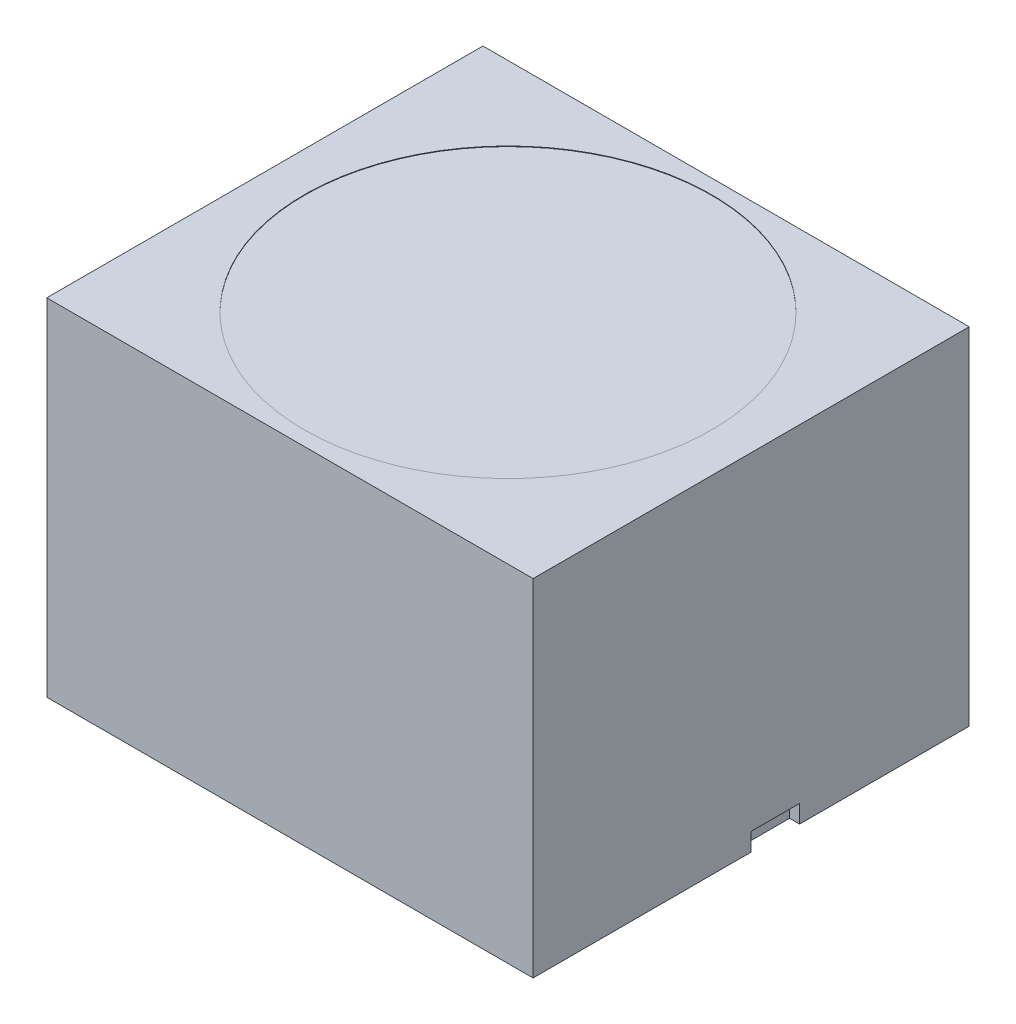
ISO-10303-21;
HEADER;
FILE_DESCRIPTION(('STEP AP214'),'2;1');
FILE_NAME('part.step','',(''),(''),'','','');
FILE_SCHEMA(('AUTOMOTIVE_DESIGN { 1 0 10303 214 1 1 1 1 }'));
ENDSEC;
DATA;
#1=APPLICATION_CONTEXT('core data for automotive mechanical design processes');
#2=APPLICATION_PROTOCOL_DEFINITION('international standard','automotive_design',2000,#1);
#3=PRODUCT_CONTEXT('',#1,'mechanical');
#4=PRODUCT('Part','Part','',(#3));
#5=PRODUCT_RELATED_PRODUCT_CATEGORY('part','',(#4));
#6=PRODUCT_DEFINITION_FORMATION('','',#4);
#7=PRODUCT_DEFINITION_CONTEXT('part definition',#1,'design');
#8=PRODUCT_DEFINITION('design','',#6,#7);
#9=PRODUCT_DEFINITION_SHAPE('','',#8);
#10=(LENGTH_UNIT() NAMED_UNIT(*) SI_UNIT(.MILLI.,.METRE.));
#11=(NAMED_UNIT(*) PLANE_ANGLE_UNIT() SI_UNIT($,.RADIAN.));
#12=(NAMED_UNIT(*) SI_UNIT($,.STERADIAN.) SOLID_ANGLE_UNIT());
#13=UNCERTAINTY_MEASURE_WITH_UNIT(LENGTH_MEASURE(1.E-05),#10,'distance_accuracy_value','');
#14=(GEOMETRIC_REPRESENTATION_CONTEXT(3) GLOBAL_UNCERTAINTY_ASSIGNED_CONTEXT((#13)) GLOBAL_UNIT_ASSIGNED_CONTEXT((#10,
#11,#12)) REPRESENTATION_CONTEXT('',''));
#15=CARTESIAN_POINT('',(0.,0.,0.));
#16=DIRECTION('',(0.,0.,1.));
#17=DIRECTION('',(1.,0.,0.));
#18=AXIS2_PLACEMENT_3D('',#15,#16,#17);
#19=CARTESIAN_POINT('',(48.5,69.,43.5));
#20=DIRECTION('',(-1.,0.,0.));
#21=DIRECTION('',(0.,0.,1.));
#22=AXIS2_PLACEMENT_3D('',#19,#20,#21);
#23=PLANE('',#22);
#24=DIRECTION('',(0.,0.,-1.));
#25=VECTOR('',#24,1.);
#26=CARTESIAN_POINT('',(48.5,0.,43.5));
#27=LINE('',#26,#25);
#28=CARTESIAN_POINT('',(48.5,0.,43.5));
#29=VERTEX_POINT('',#28);
#30=CARTESIAN_POINT('',(48.5,0.,0.));
#31=VERTEX_POINT('',#30);
#32=EDGE_CURVE('E148',#29,#31,#27,.T.);
#33=ORIENTED_EDGE('',*,*,#32,.T.);
#34=DIRECTION('',(0.,-1.,0.));
#35=VECTOR('',#34,1.);
#36=CARTESIAN_POINT('',(48.5,0.,0.));
#37=LINE('',#36,#35);
#38=CARTESIAN_POINT('',(48.5,3.57835867469044,0.));
#39=VERTEX_POINT('',#38);
#40=EDGE_CURVE('E168',#39,#31,#37,.T.);
#41=ORIENTED_EDGE('',*,*,#40,.F.);
#42=DIRECTION('',(0.,0.,1.));
#43=VECTOR('',#42,1.);
#44=CARTESIAN_POINT('',(48.5,3.57835867469044,0.));
#45=LINE('',#44,#43);
#46=CARTESIAN_POINT('',(48.5,3.57835867469044,-9.67173142205183));
#47=VERTEX_POINT('',#46);
#48=EDGE_CURVE('E192',#47,#39,#45,.T.);
#49=ORIENTED_EDGE('',*,*,#48,.F.);
#50=DIRECTION('',(0.,1.,0.));
#51=VECTOR('',#50,1.);
#52=CARTESIAN_POINT('',(48.5,0.,-9.67173142205183));
#53=LINE('',#52,#51);
#54=CARTESIAN_POINT('',(48.5,0.,-9.67173142205183));
#55=VERTEX_POINT('',#54);
#56=EDGE_CURVE('E190',#55,#47,#53,.T.);
#57=ORIENTED_EDGE('',*,*,#56,.F.);
#58=CARTESIAN_POINT('',(48.5,0.,-43.5));
#59=VERTEX_POINT('',#58);
#60=EDGE_CURVE('E127',#55,#59,#27,.T.);
#61=ORIENTED_EDGE('',*,*,#60,.T.);
#62=DIRECTION('',(0.,-1.,0.));
#63=VECTOR('',#62,1.);
#64=CARTESIAN_POINT('',(48.5,69.,-43.5));
#65=LINE('',#64,#63);
#66=CARTESIAN_POINT('',(48.5,69.,-43.5));
#67=VERTEX_POINT('',#66);
#68=EDGE_CURVE('E11',#67,#59,#65,.T.);
#69=ORIENTED_EDGE('',*,*,#68,.F.);
#70=DIRECTION('',(0.,0.,-1.));
#71=VECTOR('',#70,1.);
#72=CARTESIAN_POINT('',(48.5,69.,43.5));
#73=LINE('',#72,#71);
#74=CARTESIAN_POINT('',(48.5,69.,43.5));
#75=VERTEX_POINT('',#74);
#76=EDGE_CURVE('E141',#75,#67,#73,.T.);
#77=ORIENTED_EDGE('',*,*,#76,.F.);
#78=DIRECTION('',(0.,-1.,0.));
#79=VECTOR('',#78,1.);
#80=CARTESIAN_POINT('',(48.5,69.,43.5));
#81=LINE('',#80,#79);
#82=EDGE_CURVE('E147',#75,#29,#81,.T.);
#83=ORIENTED_EDGE('',*,*,#82,.T.);
#84=EDGE_LOOP('',(#33,#41,#49,#57,#61,#69,#77,#83));
#85=FACE_BOUND('',#84,.T.);
#86=ADVANCED_FACE('F34',(#85),#23,.F.);
#87=CARTESIAN_POINT('',(-48.5,69.,-43.5));
#88=DIRECTION('',(0.,0.,1.));
#89=DIRECTION('',(1.,0.,0.));
#90=AXIS2_PLACEMENT_3D('',#87,#88,#89);
#91=PLANE('',#90);
#92=DIRECTION('',(-1.,0.,0.));
#93=VECTOR('',#92,1.);
#94=CARTESIAN_POINT('',(-48.5,0.,-43.5));
#95=LINE('',#94,#93);
#96=CARTESIAN_POINT('',(-48.5,0.,-43.5));
#97=VERTEX_POINT('',#96);
#98=EDGE_CURVE('E151',#59,#97,#95,.T.);
#99=ORIENTED_EDGE('',*,*,#98,.T.);
#100=DIRECTION('',(0.,-1.,0.));
#101=VECTOR('',#100,1.);
#102=CARTESIAN_POINT('',(-48.5,69.,-43.5));
#103=LINE('',#102,#101);
#104=CARTESIAN_POINT('',(-48.5,69.,-43.5));
#105=VERTEX_POINT('',#104);
#106=EDGE_CURVE('E41',#105,#97,#103,.T.);
#107=ORIENTED_EDGE('',*,*,#106,.F.);
#108=DIRECTION('',(-1.,0.,0.));
#109=VECTOR('',#108,1.);
#110=CARTESIAN_POINT('',(-48.5,69.,-43.5));
#111=LINE('',#110,#109);
#112=EDGE_CURVE('E85',#67,#105,#111,.T.);
#113=ORIENTED_EDGE('',*,*,#112,.F.);
#114=ORIENTED_EDGE('',*,*,#68,.T.);
#115=EDGE_LOOP('',(#99,#107,#113,#114));
#116=FACE_BOUND('',#115,.T.);
#117=ADVANCED_FACE('F181',(#116),#91,.F.);
#118=CARTESIAN_POINT('',(-48.5,69.,43.5));
#119=DIRECTION('',(1.,0.,0.));
#120=DIRECTION('',(0.,0.,-1.));
#121=AXIS2_PLACEMENT_3D('',#118,#119,#120);
#122=PLANE('',#121);
#123=DIRECTION('',(0.,0.,1.));
#124=VECTOR('',#123,1.);
#125=CARTESIAN_POINT('',(-48.5,0.,43.5));
#126=LINE('',#125,#124);
#127=CARTESIAN_POINT('',(-48.5,0.,43.5));
#128=VERTEX_POINT('',#127);
#129=EDGE_CURVE('E153',#97,#128,#126,.T.);
#130=ORIENTED_EDGE('',*,*,#129,.T.);
#131=DIRECTION('',(0.,-1.,0.));
#132=VECTOR('',#131,1.);
#133=CARTESIAN_POINT('',(-48.5,69.,43.5));
#134=LINE('',#133,#132);
#135=CARTESIAN_POINT('',(-48.5,69.,43.5));
#136=VERTEX_POINT('',#135);
#137=EDGE_CURVE('E157',#136,#128,#134,.T.);
#138=ORIENTED_EDGE('',*,*,#137,.F.);
#139=DIRECTION('',(0.,0.,1.));
#140=VECTOR('',#139,1.);
#141=CARTESIAN_POINT('',(-48.5,69.,43.5));
#142=LINE('',#141,#140);
#143=EDGE_CURVE('E144',#105,#136,#142,.T.);
#144=ORIENTED_EDGE('',*,*,#143,.F.);
#145=ORIENTED_EDGE('',*,*,#106,.T.);
#146=EDGE_LOOP('',(#130,#138,#144,#145));
#147=FACE_BOUND('',#146,.T.);
#148=ADVANCED_FACE('F162',(#147),#122,.F.);
#149=CARTESIAN_POINT('',(-48.5,69.,43.5));
#150=DIRECTION('',(0.,0.,-1.));
#151=DIRECTION('',(-1.,0.,0.));
#152=AXIS2_PLACEMENT_3D('',#149,#150,#151);
#153=PLANE('',#152);
#154=DIRECTION('',(1.,0.,0.));
#155=VECTOR('',#154,1.);
#156=CARTESIAN_POINT('',(-48.5,0.,43.5));
#157=LINE('',#156,#155);
#158=EDGE_CURVE('E78',#128,#29,#157,.T.);
#159=ORIENTED_EDGE('',*,*,#158,.T.);
#160=ORIENTED_EDGE('',*,*,#82,.F.);
#161=DIRECTION('',(1.,0.,0.));
#162=VECTOR('',#161,1.);
#163=CARTESIAN_POINT('',(-48.5,69.,43.5));
#164=LINE('',#163,#162);
#165=EDGE_CURVE('E57',#136,#75,#164,.T.);
#166=ORIENTED_EDGE('',*,*,#165,.F.);
#167=ORIENTED_EDGE('',*,*,#137,.T.);
#168=EDGE_LOOP('',(#159,#160,#166,#167));
#169=FACE_BOUND('',#168,.T.);
#170=ADVANCED_FACE('F171',(#169),#153,.F.);
#171=CARTESIAN_POINT('',(0.,69.,0.));
#172=DIRECTION('',(0.,-1.,0.));
#173=DIRECTION('',(0.,0.,-1.));
#174=AXIS2_PLACEMENT_3D('',#171,#172,#173);
#175=PLANE('',#174);
#176=CARTESIAN_POINT('',(0.,69.,0.));
#177=DIRECTION('',(0.,1.,0.));
#178=DIRECTION('',(0.,0.,1.));
#179=AXIS2_PLACEMENT_3D('',#176,#177,#178);
#180=CIRCLE('',#179,40.6257659171274);
#181=CARTESIAN_POINT('',(0.,69.,40.6257659171274));
#182=VERTEX_POINT('',#181);
#183=EDGE_CURVE('E138',#182,#182,#180,.T.);
#184=ORIENTED_EDGE('',*,*,#183,.F.);
#185=EDGE_LOOP('',(#184));
#186=FACE_BOUND('',#185,.T.);
#187=ORIENTED_EDGE('',*,*,#76,.T.);
#188=ORIENTED_EDGE('',*,*,#112,.T.);
#189=ORIENTED_EDGE('',*,*,#143,.T.);
#190=ORIENTED_EDGE('',*,*,#165,.T.);
#191=EDGE_LOOP('',(#187,#188,#189,#190));
#192=FACE_BOUND('',#191,.T.);
#193=ADVANCED_FACE('F173',(#186,#192),#175,.F.);
#194=CARTESIAN_POINT('',(0.,0.,0.));
#195=DIRECTION('',(0.,-1.,0.));
#196=DIRECTION('',(0.,0.,-1.));
#197=AXIS2_PLACEMENT_3D('',#194,#195,#196);
#198=PLANE('',#197);
#199=DIRECTION('',(1.,0.,0.));
#200=VECTOR('',#199,1.);
#201=CARTESIAN_POINT('',(46.5,0.,0.));
#202=LINE('',#201,#200);
#203=CARTESIAN_POINT('',(46.5,0.,0.));
#204=VERTEX_POINT('',#203);
#205=EDGE_CURVE('E128',#204,#31,#202,.T.);
#206=ORIENTED_EDGE('',*,*,#205,.T.);
#207=ORIENTED_EDGE('',*,*,#32,.F.);
#208=ORIENTED_EDGE('',*,*,#158,.F.);
#209=ORIENTED_EDGE('',*,*,#129,.F.);
#210=ORIENTED_EDGE('',*,*,#98,.F.);
#211=ORIENTED_EDGE('',*,*,#60,.F.);
#212=DIRECTION('',(1.,0.,0.));
#213=VECTOR('',#212,1.);
#214=CARTESIAN_POINT('',(46.5,0.,-9.67173142205183));
#215=LINE('',#214,#213);
#216=CARTESIAN_POINT('',(46.5,0.,-9.67173142205183));
#217=VERTEX_POINT('',#216);
#218=EDGE_CURVE('E112',#217,#55,#215,.T.);
#219=ORIENTED_EDGE('',*,*,#218,.F.);
#220=DIRECTION('',(0.,0.,-1.));
#221=VECTOR('',#220,1.);
#222=CARTESIAN_POINT('',(46.5,0.,0.));
#223=LINE('',#222,#221);
#224=EDGE_CURVE('E117',#204,#217,#223,.T.);
#225=ORIENTED_EDGE('',*,*,#224,.F.);
#226=EDGE_LOOP('',(#206,#207,#208,#209,#210,#211,#219,#225));
#227=FACE_BOUND('',#226,.T.);
#228=ADVANCED_FACE('F125',(#227),#198,.T.);
#229=CARTESIAN_POINT('',(0.,68.9,0.));
#230=DIRECTION('',(0.,1.,0.));
#231=DIRECTION('',(0.,0.,1.));
#232=AXIS2_PLACEMENT_3D('',#229,#230,#231);
#233=CYLINDRICAL_SURFACE('',#232,40.6257659171274);
#234=CARTESIAN_POINT('',(0.,68.9,0.));
#235=DIRECTION('',(0.,1.,0.));
#236=DIRECTION('',(0.,0.,1.));
#237=AXIS2_PLACEMENT_3D('',#234,#235,#236);
#238=CIRCLE('',#237,40.6257659171274);
#239=CARTESIAN_POINT('',(0.,68.9,40.6257659171274));
#240=VERTEX_POINT('',#239);
#241=EDGE_CURVE('E135',#240,#240,#238,.T.);
#242=ORIENTED_EDGE('',*,*,#241,.F.);
#243=EDGE_LOOP('',(#242));
#244=FACE_BOUND('',#243,.T.);
#245=ORIENTED_EDGE('',*,*,#183,.T.);
#246=EDGE_LOOP('',(#245));
#247=FACE_BOUND('',#246,.T.);
#248=ADVANCED_FACE('F215',(#244,#247),#233,.F.);
#249=CARTESIAN_POINT('',(0.,68.9,0.));
#250=DIRECTION('',(0.,1.,0.));
#251=DIRECTION('',(0.,0.,1.));
#252=AXIS2_PLACEMENT_3D('',#249,#250,#251);
#253=PLANE('',#252);
#254=ORIENTED_EDGE('',*,*,#241,.T.);
#255=EDGE_LOOP('',(#254));
#256=FACE_BOUND('',#255,.T.);
#257=ADVANCED_FACE('F209',(#256),#253,.T.);
#258=CARTESIAN_POINT('',(46.5,0.,0.));
#259=DIRECTION('',(0.,0.,1.));
#260=DIRECTION('',(1.,0.,0.));
#261=AXIS2_PLACEMENT_3D('',#258,#259,#260);
#262=PLANE('',#261);
#263=ORIENTED_EDGE('',*,*,#40,.T.);
#264=ORIENTED_EDGE('',*,*,#205,.F.);
#265=DIRECTION('',(0.,-1.,0.));
#266=VECTOR('',#265,1.);
#267=CARTESIAN_POINT('',(46.5,0.,0.));
#268=LINE('',#267,#266);
#269=CARTESIAN_POINT('',(46.5,3.57835867469044,0.));
#270=VERTEX_POINT('',#269);
#271=EDGE_CURVE('E48',#270,#204,#268,.T.);
#272=ORIENTED_EDGE('',*,*,#271,.F.);
#273=DIRECTION('',(1.,0.,0.));
#274=VECTOR('',#273,1.);
#275=CARTESIAN_POINT('',(46.5,3.57835867469044,0.));
#276=LINE('',#275,#274);
#277=EDGE_CURVE('E130',#270,#39,#276,.T.);
#278=ORIENTED_EDGE('',*,*,#277,.T.);
#279=EDGE_LOOP('',(#263,#264,#272,#278));
#280=FACE_BOUND('',#279,.T.);
#281=ADVANCED_FACE('F198',(#280),#262,.F.);
#282=CARTESIAN_POINT('',(46.5,3.57835867469044,0.));
#283=DIRECTION('',(0.,1.,0.));
#284=DIRECTION('',(0.,0.,1.));
#285=AXIS2_PLACEMENT_3D('',#282,#283,#284);
#286=PLANE('',#285);
#287=ORIENTED_EDGE('',*,*,#48,.T.);
#288=ORIENTED_EDGE('',*,*,#277,.F.);
#289=DIRECTION('',(0.,0.,1.));
#290=VECTOR('',#289,1.);
#291=CARTESIAN_POINT('',(46.5,3.57835867469044,0.));
#292=LINE('',#291,#290);
#293=CARTESIAN_POINT('',(46.5,3.57835867469044,-9.67173142205183));
#294=VERTEX_POINT('',#293);
#295=EDGE_CURVE('E116',#294,#270,#292,.T.);
#296=ORIENTED_EDGE('',*,*,#295,.F.);
#297=DIRECTION('',(1.,0.,0.));
#298=VECTOR('',#297,1.);
#299=CARTESIAN_POINT('',(46.5,3.57835867469044,-9.67173142205183));
#300=LINE('',#299,#298);
#301=EDGE_CURVE('E114',#294,#47,#300,.T.);
#302=ORIENTED_EDGE('',*,*,#301,.T.);
#303=EDGE_LOOP('',(#287,#288,#296,#302));
#304=FACE_BOUND('',#303,.T.);
#305=ADVANCED_FACE('F200',(#304),#286,.F.);
#306=CARTESIAN_POINT('',(46.5,0.,-9.67173142205183));
#307=DIRECTION('',(0.,0.,-1.));
#308=DIRECTION('',(-1.,0.,0.));
#309=AXIS2_PLACEMENT_3D('',#306,#307,#308);
#310=PLANE('',#309);
#311=ORIENTED_EDGE('',*,*,#56,.T.);
#312=ORIENTED_EDGE('',*,*,#301,.F.);
#313=DIRECTION('',(0.,1.,0.));
#314=VECTOR('',#313,1.);
#315=CARTESIAN_POINT('',(46.5,0.,-9.67173142205183));
#316=LINE('',#315,#314);
#317=EDGE_CURVE('E108',#217,#294,#316,.T.);
#318=ORIENTED_EDGE('',*,*,#317,.F.);
#319=ORIENTED_EDGE('',*,*,#218,.T.);
#320=EDGE_LOOP('',(#311,#312,#318,#319));
#321=FACE_BOUND('',#320,.T.);
#322=ADVANCED_FACE('F110',(#321),#310,.F.);
#323=CARTESIAN_POINT('',(46.5,0.,0.));
#324=DIRECTION('',(-1.,0.,0.));
#325=DIRECTION('',(0.,0.,1.));
#326=AXIS2_PLACEMENT_3D('',#323,#324,#325);
#327=PLANE('',#326);
#328=ORIENTED_EDGE('',*,*,#271,.T.);
#329=ORIENTED_EDGE('',*,*,#224,.T.);
#330=ORIENTED_EDGE('',*,*,#317,.T.);
#331=ORIENTED_EDGE('',*,*,#295,.T.);
#332=EDGE_LOOP('',(#328,#329,#330,#331));
#333=FACE_BOUND('',#332,.T.);
#334=ADVANCED_FACE('F120',(#333),#327,.F.);
#335=CLOSED_SHELL('',(#86,#117,#148,#170,#193,#228,#248,#257,#281,#305,#322,#334));
#336=MANIFOLD_SOLID_BREP('B2',#335);
#337=ADVANCED_BREP_SHAPE_REPRESENTATION('',(#18,#336),#14);
#338=SHAPE_DEFINITION_REPRESENTATION(#9,#337);
ENDSEC;
END-ISO-10303-21;
